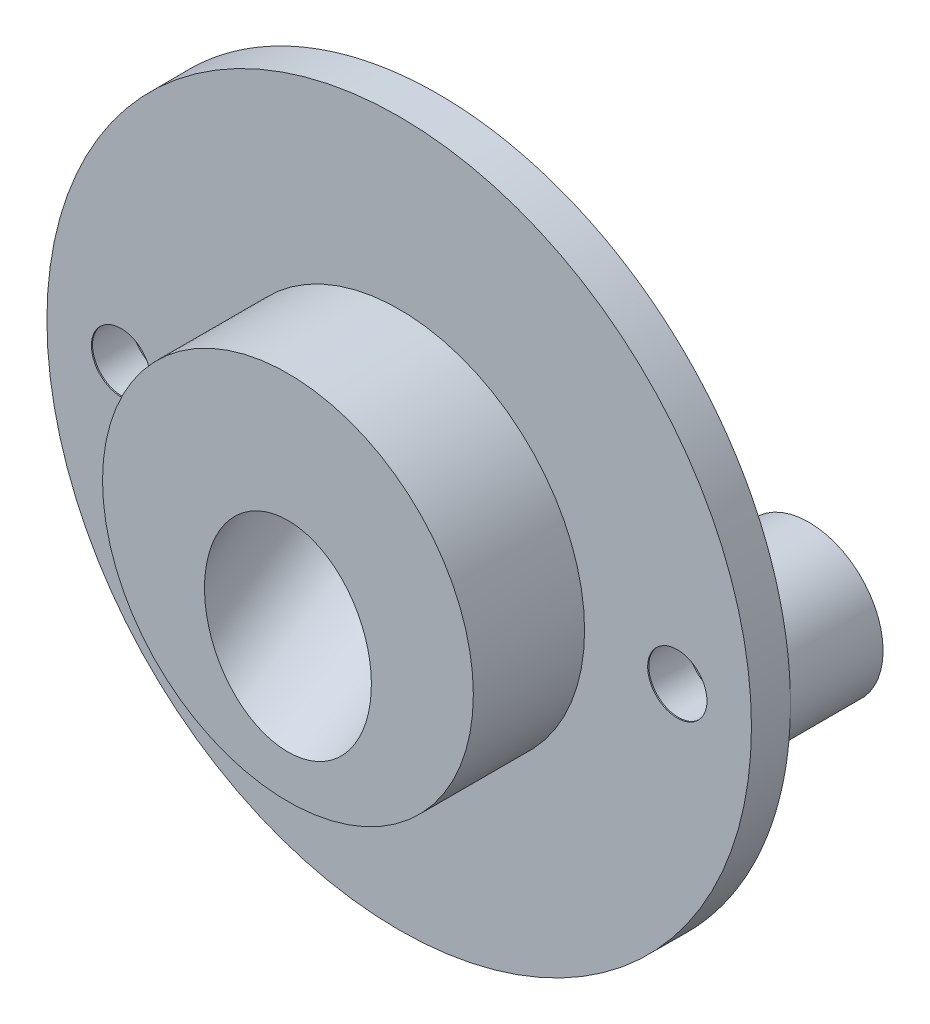
ISO-10303-21;
HEADER;
FILE_DESCRIPTION(('STEP AP214'),'2;1');
FILE_NAME('part.step','',(''),(''),'','','');
FILE_SCHEMA(('AUTOMOTIVE_DESIGN { 1 0 10303 214 1 1 1 1 }'));
ENDSEC;
DATA;
#1=APPLICATION_CONTEXT('core data for automotive mechanical design processes');
#2=APPLICATION_PROTOCOL_DEFINITION('international standard','automotive_design',2000,#1);
#3=PRODUCT_CONTEXT('',#1,'mechanical');
#4=PRODUCT('Part','Part','',(#3));
#5=PRODUCT_RELATED_PRODUCT_CATEGORY('part','',(#4));
#6=PRODUCT_DEFINITION_FORMATION('','',#4);
#7=PRODUCT_DEFINITION_CONTEXT('part definition',#1,'design');
#8=PRODUCT_DEFINITION('design','',#6,#7);
#9=PRODUCT_DEFINITION_SHAPE('','',#8);
#10=(LENGTH_UNIT() NAMED_UNIT(*) SI_UNIT(.MILLI.,.METRE.));
#11=(NAMED_UNIT(*) PLANE_ANGLE_UNIT() SI_UNIT($,.RADIAN.));
#12=(NAMED_UNIT(*) SI_UNIT($,.STERADIAN.) SOLID_ANGLE_UNIT());
#13=UNCERTAINTY_MEASURE_WITH_UNIT(LENGTH_MEASURE(1.E-05),#10,'distance_accuracy_value','');
#14=(GEOMETRIC_REPRESENTATION_CONTEXT(3) GLOBAL_UNCERTAINTY_ASSIGNED_CONTEXT((#13)) GLOBAL_UNIT_ASSIGNED_CONTEXT((#10,
#11,#12)) REPRESENTATION_CONTEXT('',''));
#15=CARTESIAN_POINT('',(0.,0.,0.));
#16=DIRECTION('',(0.,0.,1.));
#17=DIRECTION('',(1.,0.,0.));
#18=AXIS2_PLACEMENT_3D('',#15,#16,#17);
#19=CARTESIAN_POINT('',(0.,0.,0.));
#20=DIRECTION('',(0.,0.,1.));
#21=DIRECTION('',(1.,0.,0.));
#22=AXIS2_PLACEMENT_3D('',#19,#20,#21);
#23=PLANE('',#22);
#24=CARTESIAN_POINT('',(0.,3.125,0.));
#25=DIRECTION('',(0.,0.,-1.));
#26=DIRECTION('',(0.,1.,0.));
#27=AXIS2_PLACEMENT_3D('',#24,#25,#26);
#28=ELLIPSE('',#27,5.40832691319598,4.5);
#29=CARTESIAN_POINT('',(-1.98285189973723,-1.72998459167036,0.));
#30=VERTEX_POINT('',#29);
#31=CARTESIAN_POINT('',(1.98285189973723,-1.72998459167036,0.));
#32=VERTEX_POINT('',#31);
#33=EDGE_CURVE('E67',#30,#32,#28,.F.);
#34=ORIENTED_EDGE('',*,*,#33,.T.);
#35=DIRECTION('',(-1.,0.,0.));
#36=VECTOR('',#35,1.);
#37=CARTESIAN_POINT('',(0.,-1.72998459167036,0.));
#38=LINE('',#37,#36);
#39=CARTESIAN_POINT('',(4.43640638989392,-1.72998459167036,0.));
#40=VERTEX_POINT('',#39);
#41=EDGE_CURVE('E62',#40,#32,#38,.T.);
#42=ORIENTED_EDGE('',*,*,#41,.F.);
#43=CARTESIAN_POINT('',(0.,3.125,0.));
#44=DIRECTION('',(0.,0.,-1.));
#45=DIRECTION('',(0.,1.,0.));
#46=AXIS2_PLACEMENT_3D('',#43,#44,#45);
#47=ELLIPSE('',#46,7.21110255092798,6.);
#48=CARTESIAN_POINT('',(-4.43640638989392,-1.72998459167036,0.));
#49=VERTEX_POINT('',#48);
#50=EDGE_CURVE('E121',#40,#49,#47,.F.);
#51=ORIENTED_EDGE('',*,*,#50,.T.);
#52=EDGE_CURVE('E124',#30,#49,#38,.T.);
#53=ORIENTED_EDGE('',*,*,#52,.F.);
#54=EDGE_LOOP('',(#34,#42,#51,#53));
#55=FACE_BOUND('',#54,.T.);
#56=CARTESIAN_POINT('',(0.,0.,0.));
#57=DIRECTION('',(0.,0.,1.));
#58=DIRECTION('',(1.,0.,0.));
#59=AXIS2_PLACEMENT_3D('',#56,#57,#58);
#60=CIRCLE('',#59,19.);
#61=CARTESIAN_POINT('',(-19.,0.,0.));
#62=VERTEX_POINT('',#61);
#63=CARTESIAN_POINT('',(19.,0.,0.));
#64=VERTEX_POINT('',#63);
#65=EDGE_CURVE('E81',#62,#64,#60,.T.);
#66=ORIENTED_EDGE('',*,*,#65,.F.);
#67=CARTESIAN_POINT('',(-15.,0.,0.));
#68=DIRECTION('',(0.,0.,-1.));
#69=DIRECTION('',(-1.,0.,0.));
#70=AXIS2_PLACEMENT_3D('',#67,#68,#69);
#71=CIRCLE('',#70,4.);
#72=EDGE_CURVE('E87',#62,#62,#71,.T.);
#73=ORIENTED_EDGE('',*,*,#72,.F.);
#74=EDGE_CURVE('E79',#64,#62,#60,.T.);
#75=ORIENTED_EDGE('',*,*,#74,.F.);
#76=CARTESIAN_POINT('',(15.,0.,0.));
#77=DIRECTION('',(0.,0.,-1.));
#78=DIRECTION('',(-1.,0.,0.));
#79=AXIS2_PLACEMENT_3D('',#76,#77,#78);
#80=CIRCLE('',#79,4.);
#81=EDGE_CURVE('E89',#64,#64,#80,.T.);
#82=ORIENTED_EDGE('',*,*,#81,.F.);
#83=EDGE_LOOP('',(#66,#73,#75,#82));
#84=FACE_BOUND('',#83,.T.);
#85=ADVANCED_FACE('F45',(#55,#84),#23,.F.);
#86=CARTESIAN_POINT('',(0.,-6.02370412072982,13.7230561810947));
#87=DIRECTION('',(0.,0.554700196225229,-0.832050294337844));
#88=DIRECTION('',(0.,0.832050294337844,0.554700196225229));
#89=AXIS2_PLACEMENT_3D('',#86,#87,#88);
#90=CYLINDRICAL_SURFACE('',#89,4.5);
#91=CARTESIAN_POINT('',(0.,-2.275,8.1));
#92=DIRECTION('',(0.,0.,1.));
#93=DIRECTION('',(0.,1.,0.));
#94=AXIS2_PLACEMENT_3D('',#91,#92,#93);
#95=ELLIPSE('',#94,5.40832691319598,4.5);
#96=CARTESIAN_POINT('',(0.,3.13332691319599,8.1));
#97=VERTEX_POINT('',#96);
#98=EDGE_CURVE('E92',#97,#97,#95,.T.);
#99=ORIENTED_EDGE('',*,*,#98,.T.);
#100=EDGE_LOOP('',(#99));
#101=FACE_BOUND('',#100,.T.);
#102=ORIENTED_EDGE('',*,*,#33,.F.);
#103=CARTESIAN_POINT('',(0.,1.63115858717835,2.24076211923248));
#104=DIRECTION('',(0.,0.554700196225229,-0.832050294337844));
#105=DIRECTION('',(0.,0.832050294337844,0.554700196225229));
#106=AXIS2_PLACEMENT_3D('',#103,#104,#105);
#107=CIRCLE('',#106,4.5);
#108=EDGE_CURVE('E96',#32,#30,#107,.F.);
#109=ORIENTED_EDGE('',*,*,#108,.F.);
#110=EDGE_LOOP('',(#102,#109));
#111=FACE_BOUND('',#110,.T.);
#112=ADVANCED_FACE('F139',(#101,#111),#90,.F.);
#113=CARTESIAN_POINT('',(0.,1.63115858717835,2.24076211923247));
#114=DIRECTION('',(0.,0.554700196225229,-0.832050294337844));
#115=DIRECTION('',(0.,0.832050294337844,0.554700196225229));
#116=AXIS2_PLACEMENT_3D('',#113,#114,#115);
#117=PLANE('',#116);
#118=CARTESIAN_POINT('',(0.,1.63115858717835,2.24076211923247));
#119=DIRECTION('',(0.,0.554700196225229,-0.832050294337844));
#120=DIRECTION('',(0.,0.832050294337844,0.554700196225229));
#121=AXIS2_PLACEMENT_3D('',#118,#119,#120);
#122=CIRCLE('',#121,6.);
#123=EDGE_CURVE('E98',#49,#40,#122,.T.);
#124=ORIENTED_EDGE('',*,*,#123,.T.);
#125=ORIENTED_EDGE('',*,*,#41,.T.);
#126=ORIENTED_EDGE('',*,*,#108,.T.);
#127=ORIENTED_EDGE('',*,*,#52,.T.);
#128=EDGE_LOOP('',(#124,#125,#126,#127));
#129=FACE_BOUND('',#128,.T.);
#130=ADVANCED_FACE('F170',(#129),#117,.T.);
#131=CARTESIAN_POINT('',(0.,1.63115858717835,2.24076211923247));
#132=DIRECTION('',(0.,0.554700196225229,-0.832050294337844));
#133=DIRECTION('',(0.,0.832050294337844,0.554700196225229));
#134=AXIS2_PLACEMENT_3D('',#131,#132,#133);
#135=CYLINDRICAL_SURFACE('',#134,6.);
#136=ORIENTED_EDGE('',*,*,#50,.F.);
#137=ORIENTED_EDGE('',*,*,#123,.F.);
#138=EDGE_LOOP('',(#136,#137));
#139=FACE_BOUND('',#138,.T.);
#140=ADVANCED_FACE('F164',(#139),#135,.F.);
#141=CARTESIAN_POINT('',(0.,0.,2.1));
#142=DIRECTION('',(0.,0.,-1.));
#143=DIRECTION('',(-1.,0.,0.));
#144=AXIS2_PLACEMENT_3D('',#141,#142,#143);
#145=CYLINDRICAL_SURFACE('',#144,19.);
#146=CARTESIAN_POINT('',(0.,0.,2.1));
#147=DIRECTION('',(0.,0.,1.));
#148=DIRECTION('',(1.,0.,0.));
#149=AXIS2_PLACEMENT_3D('',#146,#147,#148);
#150=CIRCLE('',#149,19.);
#151=CARTESIAN_POINT('',(19.,0.,2.1));
#152=VERTEX_POINT('',#151);
#153=EDGE_CURVE('E54',#152,#152,#150,.T.);
#154=ORIENTED_EDGE('',*,*,#153,.F.);
#155=EDGE_LOOP('',(#154));
#156=FACE_BOUND('',#155,.T.);
#157=ORIENTED_EDGE('',*,*,#74,.T.);
#158=ORIENTED_EDGE('',*,*,#65,.T.);
#159=EDGE_LOOP('',(#157,#158));
#160=FACE_BOUND('',#159,.T.);
#161=ADVANCED_FACE('F47',(#156,#160),#145,.T.);
#162=CARTESIAN_POINT('',(0.,0.,2.1));
#163=DIRECTION('',(0.,0.,1.));
#164=DIRECTION('',(1.,0.,0.));
#165=AXIS2_PLACEMENT_3D('',#162,#163,#164);
#166=PLANE('',#165);
#167=CARTESIAN_POINT('',(15.,0.,2.1));
#168=DIRECTION('',(0.,0.,1.));
#169=DIRECTION('',(1.,0.,0.));
#170=AXIS2_PLACEMENT_3D('',#167,#168,#169);
#171=CIRCLE('',#170,1.6);
#172=CARTESIAN_POINT('',(16.6,0.,2.1));
#173=VERTEX_POINT('',#172);
#174=EDGE_CURVE('E131',#173,#173,#171,.T.);
#175=ORIENTED_EDGE('',*,*,#174,.F.);
#176=EDGE_LOOP('',(#175));
#177=FACE_BOUND('',#176,.T.);
#178=CARTESIAN_POINT('',(-15.,0.,2.1));
#179=DIRECTION('',(0.,0.,1.));
#180=DIRECTION('',(1.,0.,0.));
#181=AXIS2_PLACEMENT_3D('',#178,#179,#180);
#182=CIRCLE('',#181,1.6);
#183=CARTESIAN_POINT('',(-13.4,0.,2.1));
#184=VERTEX_POINT('',#183);
#185=EDGE_CURVE('E128',#184,#184,#182,.T.);
#186=ORIENTED_EDGE('',*,*,#185,.F.);
#187=EDGE_LOOP('',(#186));
#188=FACE_BOUND('',#187,.T.);
#189=CARTESIAN_POINT('',(0.,0.,2.1));
#190=DIRECTION('',(0.,0.,1.));
#191=DIRECTION('',(1.,0.,0.));
#192=AXIS2_PLACEMENT_3D('',#189,#190,#191);
#193=CIRCLE('',#192,10.);
#194=CARTESIAN_POINT('',(10.,0.,2.1));
#195=VERTEX_POINT('',#194);
#196=EDGE_CURVE('E11',#195,#195,#193,.T.);
#197=ORIENTED_EDGE('',*,*,#196,.F.);
#198=EDGE_LOOP('',(#197));
#199=FACE_BOUND('',#198,.T.);
#200=ORIENTED_EDGE('',*,*,#153,.T.);
#201=EDGE_LOOP('',(#200));
#202=FACE_BOUND('',#201,.T.);
#203=ADVANCED_FACE('F152',(#177,#188,#199,#202),#166,.T.);
#204=CARTESIAN_POINT('',(0.,0.,8.1));
#205=DIRECTION('',(0.,0.,-1.));
#206=DIRECTION('',(-1.,0.,0.));
#207=AXIS2_PLACEMENT_3D('',#204,#205,#206);
#208=CYLINDRICAL_SURFACE('',#207,10.);
#209=CARTESIAN_POINT('',(0.,0.,8.1));
#210=DIRECTION('',(0.,0.,1.));
#211=DIRECTION('',(1.,0.,0.));
#212=AXIS2_PLACEMENT_3D('',#209,#210,#211);
#213=CIRCLE('',#212,10.);
#214=CARTESIAN_POINT('',(10.,0.,8.1));
#215=VERTEX_POINT('',#214);
#216=EDGE_CURVE('E90',#215,#215,#213,.T.);
#217=ORIENTED_EDGE('',*,*,#216,.F.);
#218=EDGE_LOOP('',(#217));
#219=FACE_BOUND('',#218,.T.);
#220=ORIENTED_EDGE('',*,*,#196,.T.);
#221=EDGE_LOOP('',(#220));
#222=FACE_BOUND('',#221,.T.);
#223=ADVANCED_FACE('F146',(#219,#222),#208,.T.);
#224=CARTESIAN_POINT('',(0.,0.,8.1));
#225=DIRECTION('',(0.,0.,1.));
#226=DIRECTION('',(1.,0.,0.));
#227=AXIS2_PLACEMENT_3D('',#224,#225,#226);
#228=PLANE('',#227);
#229=ORIENTED_EDGE('',*,*,#98,.F.);
#230=EDGE_LOOP('',(#229));
#231=FACE_BOUND('',#230,.T.);
#232=ORIENTED_EDGE('',*,*,#216,.T.);
#233=EDGE_LOOP('',(#232));
#234=FACE_BOUND('',#233,.T.);
#235=ADVANCED_FACE('F142',(#231,#234),#228,.T.);
#236=CARTESIAN_POINT('',(-15.,0.,4.2));
#237=DIRECTION('',(0.,0.,-1.));
#238=DIRECTION('',(-1.,0.,0.));
#239=AXIS2_PLACEMENT_3D('',#236,#237,#238);
#240=CYLINDRICAL_SURFACE('',#239,1.6);
#241=CARTESIAN_POINT('',(-15.,0.,2.0386230095559));
#242=DIRECTION('',(0.,0.,-1.));
#243=DIRECTION('',(-1.,0.,0.));
#244=AXIS2_PLACEMENT_3D('',#241,#242,#243);
#245=CIRCLE('',#244,1.6);
#246=CARTESIAN_POINT('',(-16.6,0.,2.0386230095559));
#247=VERTEX_POINT('',#246);
#248=EDGE_CURVE('E99',#247,#247,#245,.T.);
#249=ORIENTED_EDGE('',*,*,#248,.T.);
#250=EDGE_LOOP('',(#249));
#251=FACE_BOUND('',#250,.T.);
#252=ORIENTED_EDGE('',*,*,#185,.T.);
#253=EDGE_LOOP('',(#252));
#254=FACE_BOUND('',#253,.T.);
#255=ADVANCED_FACE('F145',(#251,#254),#240,.F.);
#256=CARTESIAN_POINT('',(15.,0.,4.2));
#257=DIRECTION('',(0.,0.,-1.));
#258=DIRECTION('',(-1.,0.,0.));
#259=AXIS2_PLACEMENT_3D('',#256,#257,#258);
#260=CYLINDRICAL_SURFACE('',#259,1.6);
#261=CARTESIAN_POINT('',(15.,0.,2.0386230095559));
#262=DIRECTION('',(0.,0.,-1.));
#263=DIRECTION('',(-1.,0.,0.));
#264=AXIS2_PLACEMENT_3D('',#261,#262,#263);
#265=CIRCLE('',#264,1.6);
#266=CARTESIAN_POINT('',(13.4,0.,2.0386230095559));
#267=VERTEX_POINT('',#266);
#268=EDGE_CURVE('E49',#267,#267,#265,.T.);
#269=ORIENTED_EDGE('',*,*,#268,.T.);
#270=EDGE_LOOP('',(#269));
#271=FACE_BOUND('',#270,.T.);
#272=ORIENTED_EDGE('',*,*,#174,.T.);
#273=EDGE_LOOP('',(#272));
#274=FACE_BOUND('',#273,.T.);
#275=ADVANCED_FACE('F183',(#271,#274),#260,.F.);
#276=CARTESIAN_POINT('',(15.,0.,-5.));
#277=DIRECTION('',(0.,0.,-1.));
#278=DIRECTION('',(-1.,0.,0.));
#279=AXIS2_PLACEMENT_3D('',#276,#277,#278);
#280=PLANE('',#279);
#281=CARTESIAN_POINT('',(15.,0.,-5.));
#282=DIRECTION('',(0.,0.,-1.));
#283=DIRECTION('',(-1.,0.,0.));
#284=AXIS2_PLACEMENT_3D('',#281,#282,#283);
#285=CIRCLE('',#284,2.17499999999999);
#286=CARTESIAN_POINT('',(12.825,0.,-5.));
#287=VERTEX_POINT('',#286);
#288=EDGE_CURVE('E240',#287,#287,#285,.T.);
#289=ORIENTED_EDGE('',*,*,#288,.F.);
#290=EDGE_LOOP('',(#289));
#291=FACE_BOUND('',#290,.T.);
#292=CARTESIAN_POINT('',(15.,0.,-5.));
#293=DIRECTION('',(0.,0.,-1.));
#294=DIRECTION('',(-1.,0.,0.));
#295=AXIS2_PLACEMENT_3D('',#292,#293,#294);
#296=CIRCLE('',#295,4.);
#297=CARTESIAN_POINT('',(11.,0.,-5.));
#298=VERTEX_POINT('',#297);
#299=EDGE_CURVE('E118',#298,#298,#296,.T.);
#300=ORIENTED_EDGE('',*,*,#299,.T.);
#301=EDGE_LOOP('',(#300));
#302=FACE_BOUND('',#301,.T.);
#303=ADVANCED_FACE('F186',(#291,#302),#280,.T.);
#304=CARTESIAN_POINT('',(15.,0.,-5.));
#305=DIRECTION('',(0.,0.,1.));
#306=DIRECTION('',(1.,0.,0.));
#307=AXIS2_PLACEMENT_3D('',#304,#305,#306);
#308=CYLINDRICAL_SURFACE('',#307,4.);
#309=ORIENTED_EDGE('',*,*,#299,.F.);
#310=EDGE_LOOP('',(#309));
#311=FACE_BOUND('',#310,.T.);
#312=ORIENTED_EDGE('',*,*,#81,.T.);
#313=EDGE_LOOP('',(#312));
#314=FACE_BOUND('',#313,.T.);
#315=ADVANCED_FACE('F188',(#311,#314),#308,.T.);
#316=CARTESIAN_POINT('',(-15.,0.,-5.));
#317=DIRECTION('',(0.,0.,-1.));
#318=DIRECTION('',(-1.,0.,0.));
#319=AXIS2_PLACEMENT_3D('',#316,#317,#318);
#320=PLANE('',#319);
#321=CARTESIAN_POINT('',(-15.,0.,-5.));
#322=DIRECTION('',(0.,0.,-1.));
#323=DIRECTION('',(-1.,0.,0.));
#324=AXIS2_PLACEMENT_3D('',#321,#322,#323);
#325=CIRCLE('',#324,2.17499999999999);
#326=CARTESIAN_POINT('',(-17.175,0.,-5.));
#327=VERTEX_POINT('',#326);
#328=EDGE_CURVE('E250',#327,#327,#325,.T.);
#329=ORIENTED_EDGE('',*,*,#328,.F.);
#330=EDGE_LOOP('',(#329));
#331=FACE_BOUND('',#330,.T.);
#332=CARTESIAN_POINT('',(-15.,0.,-5.));
#333=DIRECTION('',(0.,0.,-1.));
#334=DIRECTION('',(-1.,0.,0.));
#335=AXIS2_PLACEMENT_3D('',#332,#333,#334);
#336=CIRCLE('',#335,4.);
#337=CARTESIAN_POINT('',(-19.,0.,-5.));
#338=VERTEX_POINT('',#337);
#339=EDGE_CURVE('E101',#338,#338,#336,.T.);
#340=ORIENTED_EDGE('',*,*,#339,.T.);
#341=EDGE_LOOP('',(#340));
#342=FACE_BOUND('',#341,.T.);
#343=ADVANCED_FACE('F190',(#331,#342),#320,.T.);
#344=CARTESIAN_POINT('',(-15.,0.,-5.));
#345=DIRECTION('',(0.,0.,1.));
#346=DIRECTION('',(1.,0.,0.));
#347=AXIS2_PLACEMENT_3D('',#344,#345,#346);
#348=CYLINDRICAL_SURFACE('',#347,4.);
#349=ORIENTED_EDGE('',*,*,#339,.F.);
#350=EDGE_LOOP('',(#349));
#351=FACE_BOUND('',#350,.T.);
#352=ORIENTED_EDGE('',*,*,#72,.T.);
#353=EDGE_LOOP('',(#352));
#354=FACE_BOUND('',#353,.T.);
#355=ADVANCED_FACE('F197',(#351,#354),#348,.T.);
#356=CARTESIAN_POINT('',(-15.,0.,1.94849391670177));
#357=DIRECTION('',(0.,0.,-1.));
#358=DIRECTION('',(-1.,0.,0.));
#359=AXIS2_PLACEMENT_3D('',#356,#357,#358);
#360=CONICAL_SURFACE('',#359,1.75,1.02974425867665);
#361=CARTESIAN_POINT('',(-15.,0.,1.94849391670177));
#362=DIRECTION('',(0.,0.,-1.));
#363=DIRECTION('',(-1.,0.,0.));
#364=AXIS2_PLACEMENT_3D('',#361,#362,#363);
#365=CIRCLE('',#364,1.75);
#366=CARTESIAN_POINT('',(-16.75,0.,1.94849391670177));
#367=VERTEX_POINT('',#366);
#368=EDGE_CURVE('E102',#367,#367,#365,.T.);
#369=ORIENTED_EDGE('',*,*,#368,.T.);
#370=EDGE_LOOP('',(#369));
#371=FACE_BOUND('',#370,.T.);
#372=ORIENTED_EDGE('',*,*,#248,.F.);
#373=EDGE_LOOP('',(#372));
#374=FACE_BOUND('',#373,.T.);
#375=ADVANCED_FACE('F201',(#371,#374),#360,.F.);
#376=CARTESIAN_POINT('',(-15.,0.,-5.));
#377=DIRECTION('',(0.,0.,-1.));
#378=DIRECTION('',(-1.,0.,0.));
#379=AXIS2_PLACEMENT_3D('',#376,#377,#378);
#380=CYLINDRICAL_SURFACE('',#379,1.75);
#381=ORIENTED_EDGE('',*,*,#368,.F.);
#382=EDGE_LOOP('',(#381));
#383=FACE_BOUND('',#382,.T.);
#384=CARTESIAN_POINT('',(-15.,0.,-0.200000000000001));
#385=DIRECTION('',(0.,0.,-1.));
#386=DIRECTION('',(-1.,0.,0.));
#387=AXIS2_PLACEMENT_3D('',#384,#385,#386);
#388=CIRCLE('',#387,1.75);
#389=CARTESIAN_POINT('',(-16.75,0.,-0.200000000000001));
#390=VERTEX_POINT('',#389);
#391=EDGE_CURVE('E108',#390,#390,#388,.T.);
#392=ORIENTED_EDGE('',*,*,#391,.T.);
#393=EDGE_LOOP('',(#392));
#394=FACE_BOUND('',#393,.T.);
#395=ADVANCED_FACE('F205',(#383,#394),#380,.F.);
#396=CARTESIAN_POINT('',(-13.25,0.,-0.200000000000001));
#397=DIRECTION('',(0.,0.,1.));
#398=DIRECTION('',(1.,0.,0.));
#399=AXIS2_PLACEMENT_3D('',#396,#397,#398);
#400=PLANE('',#399);
#401=ORIENTED_EDGE('',*,*,#391,.F.);
#402=EDGE_LOOP('',(#401));
#403=FACE_BOUND('',#402,.T.);
#404=CARTESIAN_POINT('',(-15.,0.,-0.200000000000001));
#405=DIRECTION('',(0.,0.,-1.));
#406=DIRECTION('',(-1.,0.,0.));
#407=AXIS2_PLACEMENT_3D('',#404,#405,#406);
#408=CIRCLE('',#407,2.175);
#409=CARTESIAN_POINT('',(-17.175,0.,-0.200000000000001));
#410=VERTEX_POINT('',#409);
#411=EDGE_CURVE('E113',#410,#410,#408,.T.);
#412=ORIENTED_EDGE('',*,*,#411,.T.);
#413=EDGE_LOOP('',(#412));
#414=FACE_BOUND('',#413,.T.);
#415=ADVANCED_FACE('F208',(#403,#414),#400,.F.);
#416=CARTESIAN_POINT('',(-15.,0.,-5.));
#417=DIRECTION('',(0.,0.,-1.));
#418=DIRECTION('',(-1.,0.,0.));
#419=AXIS2_PLACEMENT_3D('',#416,#417,#418);
#420=CYLINDRICAL_SURFACE('',#419,2.17499999999999);
#421=ORIENTED_EDGE('',*,*,#411,.F.);
#422=EDGE_LOOP('',(#421));
#423=FACE_BOUND('',#422,.T.);
#424=ORIENTED_EDGE('',*,*,#328,.T.);
#425=EDGE_LOOP('',(#424));
#426=FACE_BOUND('',#425,.T.);
#427=ADVANCED_FACE('F212',(#423,#426),#420,.F.);
#428=CARTESIAN_POINT('',(15.,0.,1.94849391670177));
#429=DIRECTION('',(0.,0.,-1.));
#430=DIRECTION('',(-1.,0.,0.));
#431=AXIS2_PLACEMENT_3D('',#428,#429,#430);
#432=CONICAL_SURFACE('',#431,1.75,1.02974425867665);
#433=CARTESIAN_POINT('',(15.,0.,1.94849391670177));
#434=DIRECTION('',(0.,0.,-1.));
#435=DIRECTION('',(-1.,0.,0.));
#436=AXIS2_PLACEMENT_3D('',#433,#434,#435);
#437=CIRCLE('',#436,1.75);
#438=CARTESIAN_POINT('',(13.25,0.,1.94849391670177));
#439=VERTEX_POINT('',#438);
#440=EDGE_CURVE('E247',#439,#439,#437,.T.);
#441=ORIENTED_EDGE('',*,*,#440,.T.);
#442=EDGE_LOOP('',(#441));
#443=FACE_BOUND('',#442,.T.);
#444=ORIENTED_EDGE('',*,*,#268,.F.);
#445=EDGE_LOOP('',(#444));
#446=FACE_BOUND('',#445,.T.);
#447=ADVANCED_FACE('F216',(#443,#446),#432,.F.);
#448=CARTESIAN_POINT('',(15.,0.,-5.));
#449=DIRECTION('',(0.,0.,-1.));
#450=DIRECTION('',(-1.,0.,0.));
#451=AXIS2_PLACEMENT_3D('',#448,#449,#450);
#452=CYLINDRICAL_SURFACE('',#451,1.75);
#453=ORIENTED_EDGE('',*,*,#440,.F.);
#454=EDGE_LOOP('',(#453));
#455=FACE_BOUND('',#454,.T.);
#456=CARTESIAN_POINT('',(15.,0.,-0.200000000000001));
#457=DIRECTION('',(0.,0.,-1.));
#458=DIRECTION('',(-1.,0.,0.));
#459=AXIS2_PLACEMENT_3D('',#456,#457,#458);
#460=CIRCLE('',#459,1.75);
#461=CARTESIAN_POINT('',(13.25,0.,-0.200000000000001));
#462=VERTEX_POINT('',#461);
#463=EDGE_CURVE('E242',#462,#462,#460,.T.);
#464=ORIENTED_EDGE('',*,*,#463,.T.);
#465=EDGE_LOOP('',(#464));
#466=FACE_BOUND('',#465,.T.);
#467=ADVANCED_FACE('F220',(#455,#466),#452,.F.);
#468=CARTESIAN_POINT('',(16.75,0.,-0.200000000000001));
#469=DIRECTION('',(0.,0.,1.));
#470=DIRECTION('',(1.,0.,0.));
#471=AXIS2_PLACEMENT_3D('',#468,#469,#470);
#472=PLANE('',#471);
#473=ORIENTED_EDGE('',*,*,#463,.F.);
#474=EDGE_LOOP('',(#473));
#475=FACE_BOUND('',#474,.T.);
#476=CARTESIAN_POINT('',(15.,0.,-0.200000000000001));
#477=DIRECTION('',(0.,0.,-1.));
#478=DIRECTION('',(-1.,0.,0.));
#479=AXIS2_PLACEMENT_3D('',#476,#477,#478);
#480=CIRCLE('',#479,2.175);
#481=CARTESIAN_POINT('',(12.825,0.,-0.200000000000001));
#482=VERTEX_POINT('',#481);
#483=EDGE_CURVE('E237',#482,#482,#480,.T.);
#484=ORIENTED_EDGE('',*,*,#483,.T.);
#485=EDGE_LOOP('',(#484));
#486=FACE_BOUND('',#485,.T.);
#487=ADVANCED_FACE('F224',(#475,#486),#472,.F.);
#488=CARTESIAN_POINT('',(15.,0.,-5.));
#489=DIRECTION('',(0.,0.,-1.));
#490=DIRECTION('',(-1.,0.,0.));
#491=AXIS2_PLACEMENT_3D('',#488,#489,#490);
#492=CYLINDRICAL_SURFACE('',#491,2.17499999999999);
#493=ORIENTED_EDGE('',*,*,#483,.F.);
#494=EDGE_LOOP('',(#493));
#495=FACE_BOUND('',#494,.T.);
#496=ORIENTED_EDGE('',*,*,#288,.T.);
#497=EDGE_LOOP('',(#496));
#498=FACE_BOUND('',#497,.T.);
#499=ADVANCED_FACE('F228',(#495,#498),#492,.F.);
#500=CLOSED_SHELL('',(#85,#112,#130,#140,#161,#203,#223,#235,#255,#275,#303,#315,#343,#355,#375,
#395,#415,#427,#447,#467,#487,#499));
#501=MANIFOLD_SOLID_BREP('B2',#500);
#502=ADVANCED_BREP_SHAPE_REPRESENTATION('',(#18,#501),#14);
#503=SHAPE_DEFINITION_REPRESENTATION(#9,#502);
ENDSEC;
END-ISO-10303-21;
